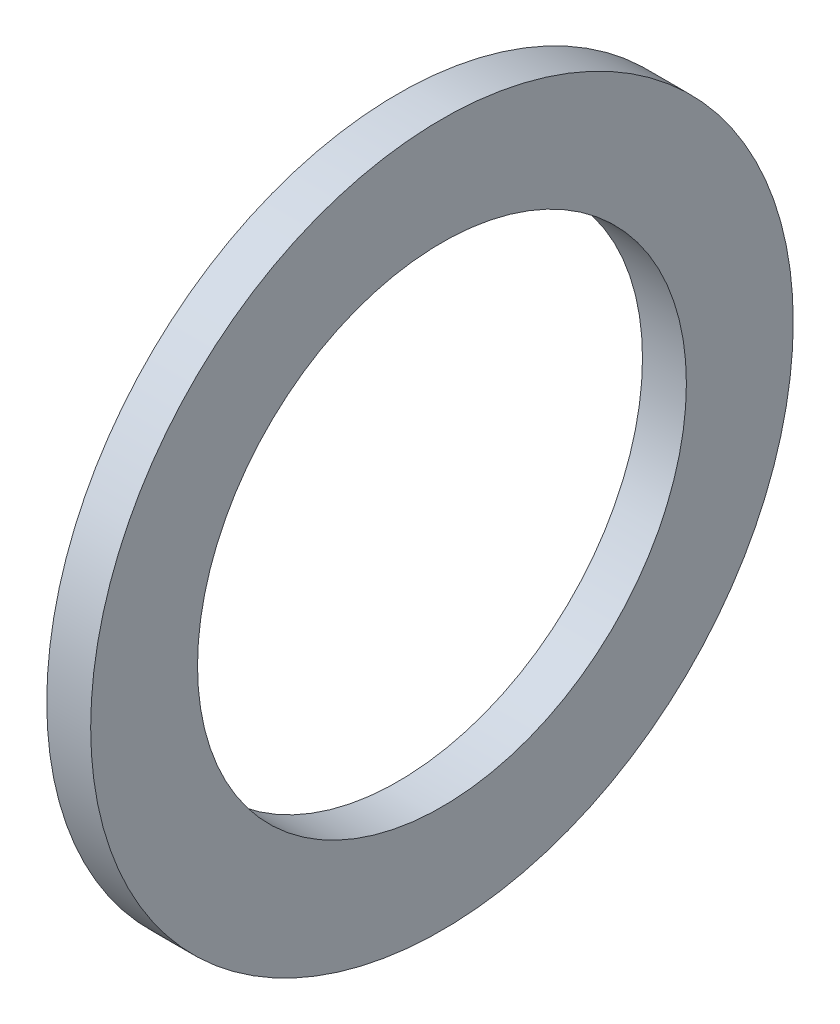
ISO-10303-21;
HEADER;
FILE_DESCRIPTION(('STEP AP214'),'2;1');
FILE_NAME('part.step','',(''),(''),'','','');
FILE_SCHEMA(('AUTOMOTIVE_DESIGN { 1 0 10303 214 1 1 1 1 }'));
ENDSEC;
DATA;
#1=APPLICATION_CONTEXT('core data for automotive mechanical design processes');
#2=APPLICATION_PROTOCOL_DEFINITION('international standard','automotive_design',2000,#1);
#3=PRODUCT_CONTEXT('',#1,'mechanical');
#4=PRODUCT('Part','Part','',(#3));
#5=PRODUCT_RELATED_PRODUCT_CATEGORY('part','',(#4));
#6=PRODUCT_DEFINITION_FORMATION('','',#4);
#7=PRODUCT_DEFINITION_CONTEXT('part definition',#1,'design');
#8=PRODUCT_DEFINITION('design','',#6,#7);
#9=PRODUCT_DEFINITION_SHAPE('','',#8);
#10=(LENGTH_UNIT() NAMED_UNIT(*) SI_UNIT(.MILLI.,.METRE.));
#11=(NAMED_UNIT(*) PLANE_ANGLE_UNIT() SI_UNIT($,.RADIAN.));
#12=(NAMED_UNIT(*) SI_UNIT($,.STERADIAN.) SOLID_ANGLE_UNIT());
#13=UNCERTAINTY_MEASURE_WITH_UNIT(LENGTH_MEASURE(1.E-05),#10,'distance_accuracy_value','');
#14=(GEOMETRIC_REPRESENTATION_CONTEXT(3) GLOBAL_UNCERTAINTY_ASSIGNED_CONTEXT((#13)) GLOBAL_UNIT_ASSIGNED_CONTEXT((#10,
#11,#12)) REPRESENTATION_CONTEXT('',''));
#15=CARTESIAN_POINT('',(0.,0.,0.));
#16=DIRECTION('',(0.,0.,1.));
#17=DIRECTION('',(1.,0.,0.));
#18=AXIS2_PLACEMENT_3D('',#15,#16,#17);
#19=CARTESIAN_POINT('',(591.640416263311,465.594262328118,0.));
#20=DIRECTION('',(-1.,0.,0.));
#21=DIRECTION('',(0.,0.,1.));
#22=AXIS2_PLACEMENT_3D('',#19,#20,#21);
#23=PLANE('',#22);
#24=CARTESIAN_POINT('',(591.640416263311,453.594262328118,0.));
#25=DIRECTION('',(1.,0.,0.));
#26=DIRECTION('',(0.,0.,-1.));
#27=AXIS2_PLACEMENT_3D('',#24,#25,#26);
#28=CIRCLE('',#27,12.);
#29=CARTESIAN_POINT('',(591.640416263311,453.594262328118,-12.));
#30=VERTEX_POINT('',#29);
#31=EDGE_CURVE('E43',#30,#30,#28,.T.);
#32=ORIENTED_EDGE('',*,*,#31,.F.);
#33=EDGE_LOOP('',(#32));
#34=FACE_BOUND('',#33,.T.);
#35=CARTESIAN_POINT('',(591.640416263311,453.594262328118,0.));
#36=DIRECTION('',(1.,0.,0.));
#37=DIRECTION('',(0.,0.,-1.));
#38=AXIS2_PLACEMENT_3D('',#35,#36,#37);
#39=CIRCLE('',#38,8.35000000000002);
#40=CARTESIAN_POINT('',(591.640416263311,453.594262328118,-8.35000000000002));
#41=VERTEX_POINT('',#40);
#42=EDGE_CURVE('E47',#41,#41,#39,.T.);
#43=ORIENTED_EDGE('',*,*,#42,.T.);
#44=EDGE_LOOP('',(#43));
#45=FACE_BOUND('',#44,.T.);
#46=ADVANCED_FACE('F37',(#34,#45),#23,.T.);
#47=CARTESIAN_POINT('',(593.140416263311,465.594262328118,0.));
#48=DIRECTION('',(1.,0.,0.));
#49=DIRECTION('',(0.,0.,-1.));
#50=AXIS2_PLACEMENT_3D('',#47,#48,#49);
#51=PLANE('',#50);
#52=CARTESIAN_POINT('',(593.140416263311,453.594262328118,0.));
#53=DIRECTION('',(1.,0.,0.));
#54=DIRECTION('',(0.,0.,-1.));
#55=AXIS2_PLACEMENT_3D('',#52,#53,#54);
#56=CIRCLE('',#55,12.);
#57=CARTESIAN_POINT('',(593.140416263311,453.594262328118,-12.));
#58=VERTEX_POINT('',#57);
#59=EDGE_CURVE('E10',#58,#58,#56,.T.);
#60=ORIENTED_EDGE('',*,*,#59,.T.);
#61=EDGE_LOOP('',(#60));
#62=FACE_BOUND('',#61,.T.);
#63=CARTESIAN_POINT('',(593.140416263311,453.594262328118,0.));
#64=DIRECTION('',(1.,0.,0.));
#65=DIRECTION('',(0.,0.,-1.));
#66=AXIS2_PLACEMENT_3D('',#63,#64,#65);
#67=CIRCLE('',#66,8.35000000000002);
#68=CARTESIAN_POINT('',(593.140416263311,453.594262328118,-8.35000000000002));
#69=VERTEX_POINT('',#68);
#70=EDGE_CURVE('E51',#69,#69,#67,.T.);
#71=ORIENTED_EDGE('',*,*,#70,.F.);
#72=EDGE_LOOP('',(#71));
#73=FACE_BOUND('',#72,.T.);
#74=ADVANCED_FACE('F60',(#62,#73),#51,.T.);
#75=CARTESIAN_POINT('',(593.140416263311,453.594262328118,0.));
#76=DIRECTION('',(1.,0.,0.));
#77=DIRECTION('',(0.,0.,-1.));
#78=AXIS2_PLACEMENT_3D('',#75,#76,#77);
#79=CYLINDRICAL_SURFACE('',#78,12.);
#80=ORIENTED_EDGE('',*,*,#31,.T.);
#81=EDGE_LOOP('',(#80));
#82=FACE_BOUND('',#81,.T.);
#83=ORIENTED_EDGE('',*,*,#59,.F.);
#84=EDGE_LOOP('',(#83));
#85=FACE_BOUND('',#84,.T.);
#86=ADVANCED_FACE('F62',(#82,#85),#79,.T.);
#87=CARTESIAN_POINT('',(593.140416263311,453.594262328118,0.));
#88=DIRECTION('',(1.,0.,0.));
#89=DIRECTION('',(0.,0.,-1.));
#90=AXIS2_PLACEMENT_3D('',#87,#88,#89);
#91=CYLINDRICAL_SURFACE('',#90,8.35000000000002);
#92=ORIENTED_EDGE('',*,*,#70,.T.);
#93=EDGE_LOOP('',(#92));
#94=FACE_BOUND('',#93,.T.);
#95=ORIENTED_EDGE('',*,*,#42,.F.);
#96=EDGE_LOOP('',(#95));
#97=FACE_BOUND('',#96,.T.);
#98=ADVANCED_FACE('F57',(#94,#97),#91,.F.);
#99=CLOSED_SHELL('',(#46,#74,#86,#98));
#100=MANIFOLD_SOLID_BREP('B2',#99);
#101=ADVANCED_BREP_SHAPE_REPRESENTATION('',(#18,#100),#14);
#102=SHAPE_DEFINITION_REPRESENTATION(#9,#101);
ENDSEC;
END-ISO-10303-21;
